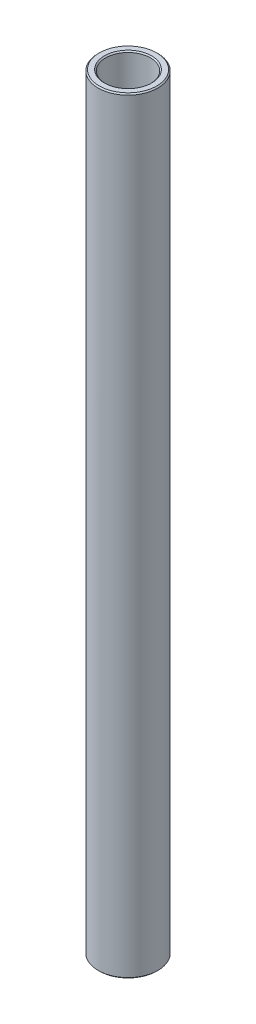
ISO-10303-21;
HEADER;
FILE_DESCRIPTION(('STEP AP214'),'2;1');
FILE_NAME('part.step','',(''),(''),'','','');
FILE_SCHEMA(('AUTOMOTIVE_DESIGN { 1 0 10303 214 1 1 1 1 }'));
ENDSEC;
DATA;
#1=APPLICATION_CONTEXT('core data for automotive mechanical design processes');
#2=APPLICATION_PROTOCOL_DEFINITION('international standard','automotive_design',2000,#1);
#3=PRODUCT_CONTEXT('',#1,'mechanical');
#4=PRODUCT('Part','Part','',(#3));
#5=PRODUCT_RELATED_PRODUCT_CATEGORY('part','',(#4));
#6=PRODUCT_DEFINITION_FORMATION('','',#4);
#7=PRODUCT_DEFINITION_CONTEXT('part definition',#1,'design');
#8=PRODUCT_DEFINITION('design','',#6,#7);
#9=PRODUCT_DEFINITION_SHAPE('','',#8);
#10=(LENGTH_UNIT() NAMED_UNIT(*) SI_UNIT(.MILLI.,.METRE.));
#11=(NAMED_UNIT(*) PLANE_ANGLE_UNIT() SI_UNIT($,.RADIAN.));
#12=(NAMED_UNIT(*) SI_UNIT($,.STERADIAN.) SOLID_ANGLE_UNIT());
#13=UNCERTAINTY_MEASURE_WITH_UNIT(LENGTH_MEASURE(1.E-05),#10,'distance_accuracy_value','');
#14=(GEOMETRIC_REPRESENTATION_CONTEXT(3) GLOBAL_UNCERTAINTY_ASSIGNED_CONTEXT((#13)) GLOBAL_UNIT_ASSIGNED_CONTEXT((#10,
#11,#12)) REPRESENTATION_CONTEXT('',''));
#15=CARTESIAN_POINT('',(0.,0.,0.));
#16=DIRECTION('',(0.,0.,1.));
#17=DIRECTION('',(1.,0.,0.));
#18=AXIS2_PLACEMENT_3D('',#15,#16,#17);
#19=CARTESIAN_POINT('',(6.35000000000027,9.52499999999755,0.));
#20=DIRECTION('',(-3.08342253367927E-12,-1.,0.));
#21=DIRECTION('',(1.,-3.08342253367927E-12,0.));
#22=AXIS2_PLACEMENT_3D('',#19,#20,#21);
#23=PLANE('',#22);
#24=CARTESIAN_POINT('',(2.93695996333478E-11,9.52500000001714,0.));
#25=DIRECTION('',(-3.08342253367927E-12,-1.,0.));
#26=DIRECTION('',(1.,-3.08342253367927E-12,0.));
#27=AXIS2_PLACEMENT_3D('',#24,#25,#26);
#28=CIRCLE('',#27,5.01649999996815);
#29=CARTESIAN_POINT('',(5.01649999999752,9.52500000000167,0.));
#30=VERTEX_POINT('',#29);
#31=EDGE_CURVE('E10',#30,#30,#28,.F.);
#32=ORIENTED_EDGE('',*,*,#31,.T.);
#33=EDGE_LOOP('',(#32));
#34=FACE_BOUND('',#33,.T.);
#35=CARTESIAN_POINT('',(2.93695996333478E-11,9.52500000001714,0.));
#36=DIRECTION('',(-3.08342253367927E-12,-1.,0.));
#37=DIRECTION('',(1.,-3.08342253367927E-12,0.));
#38=AXIS2_PLACEMENT_3D('',#35,#36,#37);
#39=CIRCLE('',#38,6.09599999996848);
#40=CARTESIAN_POINT('',(6.09599999999785,9.52499999999834,0.));
#41=VERTEX_POINT('',#40);
#42=EDGE_CURVE('E37',#41,#41,#39,.T.);
#43=ORIENTED_EDGE('',*,*,#42,.T.);
#44=EDGE_LOOP('',(#43));
#45=FACE_BOUND('',#44,.T.);
#46=ADVANCED_FACE('F30',(#34,#45),#23,.T.);
#47=CARTESIAN_POINT('',(0.,0.,0.));
#48=DIRECTION('',(-3.08342253367927E-12,-1.,0.));
#49=DIRECTION('',(1.,-3.08342253367927E-12,0.));
#50=AXIS2_PLACEMENT_3D('',#47,#48,#49);
#51=CYLINDRICAL_SURFACE('',#50,4.76249999971958);
#52=CARTESIAN_POINT('',(5.30718005296791E-10,172.119779076634,0.));
#53=DIRECTION('',(3.08342253367938E-12,1.,0.));
#54=DIRECTION('',(-1.,3.08342253367938E-12,0.));
#55=AXIS2_PLACEMENT_3D('',#52,#53,#54);
#56=CIRCLE('',#55,4.76249999971958);
#57=CARTESIAN_POINT('',(-4.76249999918886,172.119779076649,0.));
#58=VERTEX_POINT('',#57);
#59=EDGE_CURVE('E41',#58,#58,#56,.T.);
#60=ORIENTED_EDGE('',*,*,#59,.T.);
#61=EDGE_LOOP('',(#60));
#62=FACE_BOUND('',#61,.T.);
#63=CARTESIAN_POINT('',(3.01527889576688E-11,9.77900000026571,0.));
#64=DIRECTION('',(-3.08342253367927E-12,-1.,0.));
#65=DIRECTION('',(1.,-3.08342253367927E-12,0.));
#66=AXIS2_PLACEMENT_3D('',#63,#64,#65);
#67=CIRCLE('',#66,4.76249999971958);
#68=CARTESIAN_POINT('',(4.76249999974973,9.77900000025103,0.));
#69=VERTEX_POINT('',#68);
#70=EDGE_CURVE('E45',#69,#69,#67,.T.);
#71=ORIENTED_EDGE('',*,*,#70,.T.);
#72=EDGE_LOOP('',(#71));
#73=FACE_BOUND('',#72,.T.);
#74=ADVANCED_FACE('F74',(#62,#73),#51,.F.);
#75=CARTESIAN_POINT('',(4.76250000000001,172.373779076371,0.));
#76=DIRECTION('',(3.08342253367927E-12,1.,0.));
#77=DIRECTION('',(-1.,3.08342253367927E-12,0.));
#78=AXIS2_PLACEMENT_3D('',#75,#76,#77);
#79=PLANE('',#78);
#80=CARTESIAN_POINT('',(5.31501194619579E-10,172.373779076386,0.));
#81=DIRECTION('',(3.08342253367927E-12,1.,0.));
#82=DIRECTION('',(-1.,3.08342253367927E-12,0.));
#83=AXIS2_PLACEMENT_3D('',#80,#81,#82);
#84=CIRCLE('',#83,6.09599999947114);
#85=CARTESIAN_POINT('',(-6.09599999893964,172.373779076404,0.));
#86=VERTEX_POINT('',#85);
#87=EDGE_CURVE('E50',#86,#86,#84,.T.);
#88=ORIENTED_EDGE('',*,*,#87,.T.);
#89=EDGE_LOOP('',(#88));
#90=FACE_BOUND('',#89,.T.);
#91=CARTESIAN_POINT('',(5.31501194619579E-10,172.373779076386,0.));
#92=DIRECTION('',(3.08342253367927E-12,1.,0.));
#93=DIRECTION('',(-1.,3.08342253367927E-12,0.));
#94=AXIS2_PLACEMENT_3D('',#91,#92,#93);
#95=CIRCLE('',#94,5.01649999947094);
#96=CARTESIAN_POINT('',(-5.01649999893944,172.373779076401,0.));
#97=VERTEX_POINT('',#96);
#98=EDGE_CURVE('E53',#97,#97,#95,.F.);
#99=ORIENTED_EDGE('',*,*,#98,.T.);
#100=EDGE_LOOP('',(#99));
#101=FACE_BOUND('',#100,.T.);
#102=ADVANCED_FACE('F79',(#90,#101),#79,.T.);
#103=CARTESIAN_POINT('',(0.,0.,0.));
#104=DIRECTION('',(-3.08342253367927E-12,-1.,0.));
#105=DIRECTION('',(1.,-3.08342253367927E-12,0.));
#106=AXIS2_PLACEMENT_3D('',#103,#104,#105);
#107=CYLINDRICAL_SURFACE('',#106,6.34999999971984);
#108=CARTESIAN_POINT('',(5.30718005295258E-10,172.119779076137,0.));
#109=DIRECTION('',(3.08342253367924E-12,1.,0.));
#110=DIRECTION('',(-1.,3.08342253367924E-12,0.));
#111=AXIS2_PLACEMENT_3D('',#108,#109,#110);
#112=CIRCLE('',#111,6.34999999971984);
#113=CARTESIAN_POINT('',(-6.34999999918912,172.119779076157,0.));
#114=VERTEX_POINT('',#113);
#115=EDGE_CURVE('E56',#114,#114,#112,.F.);
#116=ORIENTED_EDGE('',*,*,#115,.T.);
#117=EDGE_LOOP('',(#116));
#118=FACE_BOUND('',#117,.T.);
#119=CARTESIAN_POINT('',(3.01527889561357E-11,9.7789999997685,0.));
#120=DIRECTION('',(-3.08342253367928E-12,-1.,0.));
#121=DIRECTION('',(1.,-3.08342253367928E-12,0.));
#122=AXIS2_PLACEMENT_3D('',#119,#120,#121);
#123=CIRCLE('',#122,6.34999999971984);
#124=CARTESIAN_POINT('',(6.34999999974999,9.77899999974892,0.));
#125=VERTEX_POINT('',#124);
#126=EDGE_CURVE('E59',#125,#125,#123,.F.);
#127=ORIENTED_EDGE('',*,*,#126,.T.);
#128=EDGE_LOOP('',(#127));
#129=FACE_BOUND('',#128,.T.);
#130=ADVANCED_FACE('F63',(#118,#129),#107,.T.);
#131=CARTESIAN_POINT('',(5.30718005295258E-10,172.119779076137,0.));
#132=DIRECTION('',(-3.08342253367924E-12,-1.,0.));
#133=DIRECTION('',(1.,-3.08342253367924E-12,0.));
#134=AXIS2_PLACEMENT_3D('',#131,#132,#133);
#135=CONICAL_SURFACE('',#134,6.34999999971984,0.78539816339739);
#136=ORIENTED_EDGE('',*,*,#87,.F.);
#137=EDGE_LOOP('',(#136));
#138=FACE_BOUND('',#137,.T.);
#139=ORIENTED_EDGE('',*,*,#115,.F.);
#140=EDGE_LOOP('',(#139));
#141=FACE_BOUND('',#140,.T.);
#142=ADVANCED_FACE('F84',(#138,#141),#135,.T.);
#143=CARTESIAN_POINT('',(5.31501194619579E-10,172.373779076386,0.));
#144=DIRECTION('',(3.08342253367938E-12,1.,0.));
#145=DIRECTION('',(-1.,3.08342253367938E-12,0.));
#146=AXIS2_PLACEMENT_3D('',#143,#144,#145);
#147=CONICAL_SURFACE('',#146,5.01649999947094,0.785398163397481);
#148=ORIENTED_EDGE('',*,*,#59,.F.);
#149=EDGE_LOOP('',(#148));
#150=FACE_BOUND('',#149,.T.);
#151=ORIENTED_EDGE('',*,*,#98,.F.);
#152=EDGE_LOOP('',(#151));
#153=FACE_BOUND('',#152,.T.);
#154=ADVANCED_FACE('F71',(#150,#153),#147,.F.);
#155=CARTESIAN_POINT('',(3.01527889576688E-11,9.77900000026571,0.));
#156=DIRECTION('',(-3.08342253367927E-12,-1.,0.));
#157=DIRECTION('',(1.,-3.08342253367927E-12,0.));
#158=AXIS2_PLACEMENT_3D('',#155,#156,#157);
#159=CONICAL_SURFACE('',#158,4.76249999971958,0.785398163397433);
#160=ORIENTED_EDGE('',*,*,#31,.F.);
#161=EDGE_LOOP('',(#160));
#162=FACE_BOUND('',#161,.T.);
#163=ORIENTED_EDGE('',*,*,#70,.F.);
#164=EDGE_LOOP('',(#163));
#165=FACE_BOUND('',#164,.T.);
#166=ADVANCED_FACE('F67',(#162,#165),#159,.F.);
#167=CARTESIAN_POINT('',(2.93695996333478E-11,9.52500000001714,0.));
#168=DIRECTION('',(3.08342253367928E-12,1.,0.));
#169=DIRECTION('',(-1.,3.08342253367928E-12,0.));
#170=AXIS2_PLACEMENT_3D('',#167,#168,#169);
#171=CONICAL_SURFACE('',#170,6.09599999996848,0.785398163397436);
#172=ORIENTED_EDGE('',*,*,#126,.F.);
#173=EDGE_LOOP('',(#172));
#174=FACE_BOUND('',#173,.T.);
#175=ORIENTED_EDGE('',*,*,#42,.F.);
#176=EDGE_LOOP('',(#175));
#177=FACE_BOUND('',#176,.T.);
#178=ADVANCED_FACE('F32',(#174,#177),#171,.T.);
#179=CLOSED_SHELL('',(#46,#74,#102,#130,#142,#154,#166,#178));
#180=MANIFOLD_SOLID_BREP('B2',#179);
#181=ADVANCED_BREP_SHAPE_REPRESENTATION('',(#18,#180),#14);
#182=SHAPE_DEFINITION_REPRESENTATION(#9,#181);
ENDSEC;
END-ISO-10303-21;
